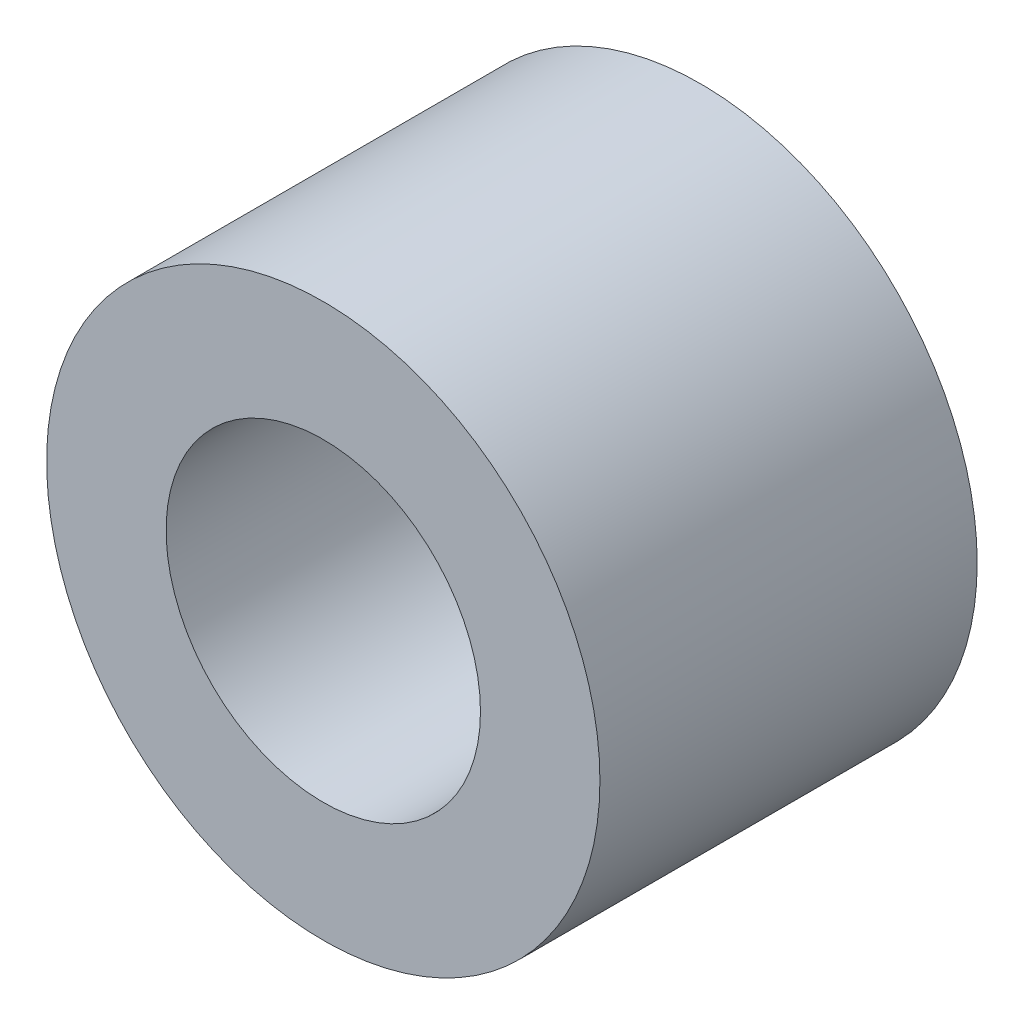
ISO-10303-21;
HEADER;
FILE_DESCRIPTION(('STEP AP214'),'2;1');
FILE_NAME('part.step','',(''),(''),'','','');
FILE_SCHEMA(('AUTOMOTIVE_DESIGN { 1 0 10303 214 1 1 1 1 }'));
ENDSEC;
DATA;
#1=APPLICATION_CONTEXT('core data for automotive mechanical design processes');
#2=APPLICATION_PROTOCOL_DEFINITION('international standard','automotive_design',2000,#1);
#3=PRODUCT_CONTEXT('',#1,'mechanical');
#4=PRODUCT('Part','Part','',(#3));
#5=PRODUCT_RELATED_PRODUCT_CATEGORY('part','',(#4));
#6=PRODUCT_DEFINITION_FORMATION('','',#4);
#7=PRODUCT_DEFINITION_CONTEXT('part definition',#1,'design');
#8=PRODUCT_DEFINITION('design','',#6,#7);
#9=PRODUCT_DEFINITION_SHAPE('','',#8);
#10=(LENGTH_UNIT() NAMED_UNIT(*) SI_UNIT(.MILLI.,.METRE.));
#11=(NAMED_UNIT(*) PLANE_ANGLE_UNIT() SI_UNIT($,.RADIAN.));
#12=(NAMED_UNIT(*) SI_UNIT($,.STERADIAN.) SOLID_ANGLE_UNIT());
#13=UNCERTAINTY_MEASURE_WITH_UNIT(LENGTH_MEASURE(1.E-05),#10,'distance_accuracy_value','');
#14=(GEOMETRIC_REPRESENTATION_CONTEXT(3) GLOBAL_UNCERTAINTY_ASSIGNED_CONTEXT((#13)) GLOBAL_UNIT_ASSIGNED_CONTEXT((#10,
#11,#12)) REPRESENTATION_CONTEXT('',''));
#15=CARTESIAN_POINT('',(0.,0.,0.));
#16=DIRECTION('',(0.,0.,1.));
#17=DIRECTION('',(1.,0.,0.));
#18=AXIS2_PLACEMENT_3D('',#15,#16,#17);
#19=CARTESIAN_POINT('',(0.,0.,3.));
#20=DIRECTION('',(0.,0.,1.));
#21=DIRECTION('',(1.,0.,0.));
#22=AXIS2_PLACEMENT_3D('',#19,#20,#21);
#23=PLANE('',#22);
#24=CARTESIAN_POINT('',(0.,0.,3.));
#25=DIRECTION('',(0.,0.,1.));
#26=DIRECTION('',(1.,0.,0.));
#27=AXIS2_PLACEMENT_3D('',#24,#25,#26);
#28=CIRCLE('',#27,2.2);
#29=CARTESIAN_POINT('',(2.2,0.,3.));
#30=VERTEX_POINT('',#29);
#31=EDGE_CURVE('E10',#30,#30,#28,.T.);
#32=ORIENTED_EDGE('',*,*,#31,.T.);
#33=EDGE_LOOP('',(#32));
#34=FACE_BOUND('',#33,.T.);
#35=CARTESIAN_POINT('',(0.,0.,3.));
#36=DIRECTION('',(0.,0.,1.));
#37=DIRECTION('',(1.,0.,0.));
#38=AXIS2_PLACEMENT_3D('',#35,#36,#37);
#39=CIRCLE('',#38,1.25);
#40=CARTESIAN_POINT('',(1.25,0.,3.));
#41=VERTEX_POINT('',#40);
#42=EDGE_CURVE('E50',#41,#41,#39,.T.);
#43=ORIENTED_EDGE('',*,*,#42,.F.);
#44=EDGE_LOOP('',(#43));
#45=FACE_BOUND('',#44,.T.);
#46=ADVANCED_FACE('F37',(#34,#45),#23,.T.);
#47=CARTESIAN_POINT('',(0.,0.,0.));
#48=DIRECTION('',(0.,0.,1.));
#49=DIRECTION('',(1.,0.,0.));
#50=AXIS2_PLACEMENT_3D('',#47,#48,#49);
#51=PLANE('',#50);
#52=CARTESIAN_POINT('',(0.,0.,0.));
#53=DIRECTION('',(0.,0.,1.));
#54=DIRECTION('',(1.,0.,0.));
#55=AXIS2_PLACEMENT_3D('',#52,#53,#54);
#56=CIRCLE('',#55,2.2);
#57=CARTESIAN_POINT('',(2.2,0.,0.));
#58=VERTEX_POINT('',#57);
#59=EDGE_CURVE('E41',#58,#58,#56,.T.);
#60=ORIENTED_EDGE('',*,*,#59,.F.);
#61=EDGE_LOOP('',(#60));
#62=FACE_BOUND('',#61,.T.);
#63=CARTESIAN_POINT('',(0.,0.,0.));
#64=DIRECTION('',(0.,0.,1.));
#65=DIRECTION('',(1.,0.,0.));
#66=AXIS2_PLACEMENT_3D('',#63,#64,#65);
#67=CIRCLE('',#66,1.25);
#68=CARTESIAN_POINT('',(1.25,0.,0.));
#69=VERTEX_POINT('',#68);
#70=EDGE_CURVE('E52',#69,#69,#67,.T.);
#71=ORIENTED_EDGE('',*,*,#70,.T.);
#72=EDGE_LOOP('',(#71));
#73=FACE_BOUND('',#72,.T.);
#74=ADVANCED_FACE('F64',(#62,#73),#51,.F.);
#75=CARTESIAN_POINT('',(0.,0.,3.));
#76=DIRECTION('',(0.,0.,-1.));
#77=DIRECTION('',(-1.,0.,0.));
#78=AXIS2_PLACEMENT_3D('',#75,#76,#77);
#79=CYLINDRICAL_SURFACE('',#78,2.2);
#80=ORIENTED_EDGE('',*,*,#31,.F.);
#81=EDGE_LOOP('',(#80));
#82=FACE_BOUND('',#81,.T.);
#83=ORIENTED_EDGE('',*,*,#59,.T.);
#84=EDGE_LOOP('',(#83));
#85=FACE_BOUND('',#84,.T.);
#86=ADVANCED_FACE('F39',(#82,#85),#79,.T.);
#87=CARTESIAN_POINT('',(0.,0.,3.));
#88=DIRECTION('',(0.,0.,-1.));
#89=DIRECTION('',(-1.,0.,0.));
#90=AXIS2_PLACEMENT_3D('',#87,#88,#89);
#91=CYLINDRICAL_SURFACE('',#90,1.25);
#92=ORIENTED_EDGE('',*,*,#42,.T.);
#93=EDGE_LOOP('',(#92));
#94=FACE_BOUND('',#93,.T.);
#95=ORIENTED_EDGE('',*,*,#70,.F.);
#96=EDGE_LOOP('',(#95));
#97=FACE_BOUND('',#96,.T.);
#98=ADVANCED_FACE('F60',(#94,#97),#91,.F.);
#99=CLOSED_SHELL('',(#46,#74,#86,#98));
#100=MANIFOLD_SOLID_BREP('B2',#99);
#101=ADVANCED_BREP_SHAPE_REPRESENTATION('',(#18,#100),#14);
#102=SHAPE_DEFINITION_REPRESENTATION(#9,#101);
ENDSEC;
END-ISO-10303-21;
